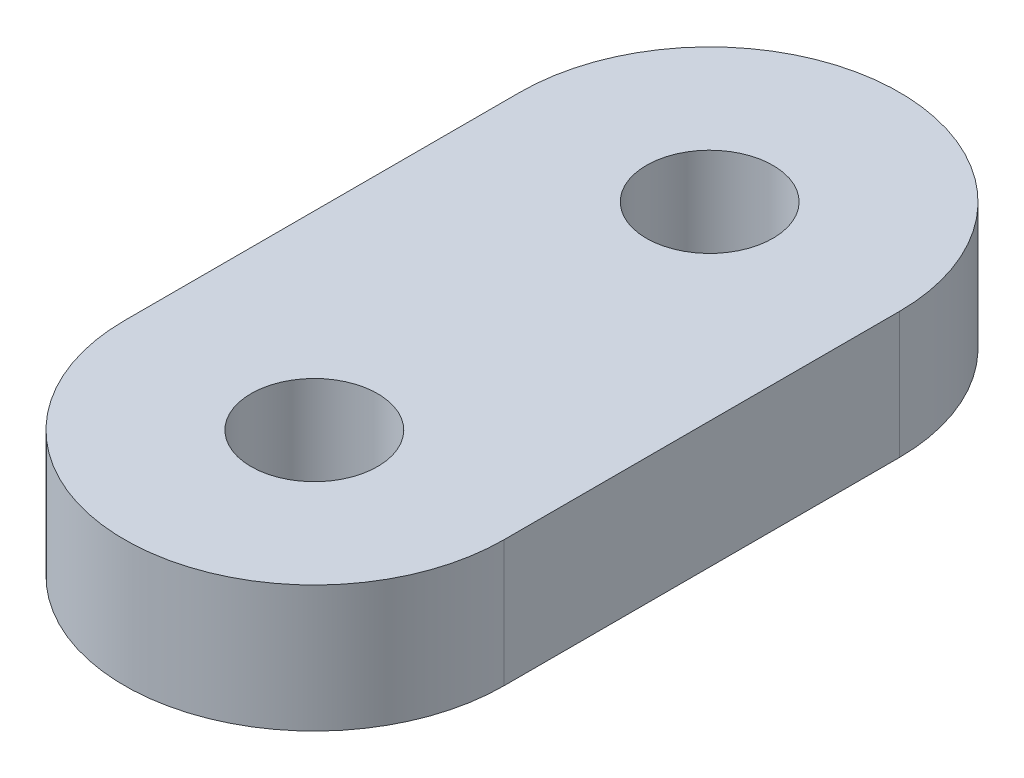
ISO-10303-21;
HEADER;
FILE_DESCRIPTION(('STEP AP214'),'2;1');
FILE_NAME('part.step','',(''),(''),'','','');
FILE_SCHEMA(('AUTOMOTIVE_DESIGN { 1 0 10303 214 1 1 1 1 }'));
ENDSEC;
DATA;
#1=APPLICATION_CONTEXT('core data for automotive mechanical design processes');
#2=APPLICATION_PROTOCOL_DEFINITION('international standard','automotive_design',2000,#1);
#3=PRODUCT_CONTEXT('',#1,'mechanical');
#4=PRODUCT('Part','Part','',(#3));
#5=PRODUCT_RELATED_PRODUCT_CATEGORY('part','',(#4));
#6=PRODUCT_DEFINITION_FORMATION('','',#4);
#7=PRODUCT_DEFINITION_CONTEXT('part definition',#1,'design');
#8=PRODUCT_DEFINITION('design','',#6,#7);
#9=PRODUCT_DEFINITION_SHAPE('','',#8);
#10=(LENGTH_UNIT() NAMED_UNIT(*) SI_UNIT(.MILLI.,.METRE.));
#11=(NAMED_UNIT(*) PLANE_ANGLE_UNIT() SI_UNIT($,.RADIAN.));
#12=(NAMED_UNIT(*) SI_UNIT($,.STERADIAN.) SOLID_ANGLE_UNIT());
#13=UNCERTAINTY_MEASURE_WITH_UNIT(LENGTH_MEASURE(1.E-05),#10,'distance_accuracy_value','');
#14=(GEOMETRIC_REPRESENTATION_CONTEXT(3) GLOBAL_UNCERTAINTY_ASSIGNED_CONTEXT((#13)) GLOBAL_UNIT_ASSIGNED_CONTEXT((#10,
#11,#12)) REPRESENTATION_CONTEXT('',''));
#15=CARTESIAN_POINT('',(0.,0.,0.));
#16=DIRECTION('',(0.,0.,1.));
#17=DIRECTION('',(1.,0.,0.));
#18=AXIS2_PLACEMENT_3D('',#15,#16,#17);
#19=CARTESIAN_POINT('',(0.,4.,-6.25));
#20=DIRECTION('',(0.,-1.,0.));
#21=DIRECTION('',(0.,0.,-1.));
#22=AXIS2_PLACEMENT_3D('',#19,#20,#21);
#23=CYLINDRICAL_SURFACE('',#22,6.);
#24=CARTESIAN_POINT('',(0.,0.,-6.25));
#25=DIRECTION('',(0.,1.,0.));
#26=DIRECTION('',(0.,0.,1.));
#27=AXIS2_PLACEMENT_3D('',#24,#25,#26);
#28=CIRCLE('',#27,6.);
#29=CARTESIAN_POINT('',(6.,0.,-6.25));
#30=VERTEX_POINT('',#29);
#31=CARTESIAN_POINT('',(-6.,0.,-6.25));
#32=VERTEX_POINT('',#31);
#33=EDGE_CURVE('E97',#30,#32,#28,.T.);
#34=ORIENTED_EDGE('',*,*,#33,.T.);
#35=DIRECTION('',(0.,-1.,0.));
#36=VECTOR('',#35,1.);
#37=CARTESIAN_POINT('',(-6.,4.,-6.25));
#38=LINE('',#37,#36);
#39=CARTESIAN_POINT('',(-6.,4.,-6.25));
#40=VERTEX_POINT('',#39);
#41=EDGE_CURVE('E11',#40,#32,#38,.T.);
#42=ORIENTED_EDGE('',*,*,#41,.F.);
#43=CARTESIAN_POINT('',(0.,4.,-6.25));
#44=DIRECTION('',(0.,1.,0.));
#45=DIRECTION('',(0.,0.,1.));
#46=AXIS2_PLACEMENT_3D('',#43,#44,#45);
#47=CIRCLE('',#46,6.);
#48=CARTESIAN_POINT('',(6.,4.,-6.25));
#49=VERTEX_POINT('',#48);
#50=EDGE_CURVE('E85',#49,#40,#47,.T.);
#51=ORIENTED_EDGE('',*,*,#50,.F.);
#52=DIRECTION('',(0.,-1.,0.));
#53=VECTOR('',#52,1.);
#54=CARTESIAN_POINT('',(6.,4.,-6.25));
#55=LINE('',#54,#53);
#56=EDGE_CURVE('E93',#49,#30,#55,.T.);
#57=ORIENTED_EDGE('',*,*,#56,.T.);
#58=EDGE_LOOP('',(#34,#42,#51,#57));
#59=FACE_BOUND('',#58,.T.);
#60=ADVANCED_FACE('F34',(#59),#23,.T.);
#61=CARTESIAN_POINT('',(-6.,4.,-6.25));
#62=DIRECTION('',(1.,0.,0.));
#63=DIRECTION('',(0.,0.,-1.));
#64=AXIS2_PLACEMENT_3D('',#61,#62,#63);
#65=PLANE('',#64);
#66=DIRECTION('',(0.,0.,1.));
#67=VECTOR('',#66,1.);
#68=CARTESIAN_POINT('',(-6.,0.,-6.25));
#69=LINE('',#68,#67);
#70=CARTESIAN_POINT('',(-6.,0.,6.25));
#71=VERTEX_POINT('',#70);
#72=EDGE_CURVE('E89',#32,#71,#69,.T.);
#73=ORIENTED_EDGE('',*,*,#72,.T.);
#74=DIRECTION('',(0.,-1.,0.));
#75=VECTOR('',#74,1.);
#76=CARTESIAN_POINT('',(-6.,4.,6.25));
#77=LINE('',#76,#75);
#78=CARTESIAN_POINT('',(-6.,4.,6.25));
#79=VERTEX_POINT('',#78);
#80=EDGE_CURVE('E42',#79,#71,#77,.T.);
#81=ORIENTED_EDGE('',*,*,#80,.F.);
#82=DIRECTION('',(0.,0.,1.));
#83=VECTOR('',#82,1.);
#84=CARTESIAN_POINT('',(-6.,4.,-6.25));
#85=LINE('',#84,#83);
#86=EDGE_CURVE('E80',#40,#79,#85,.T.);
#87=ORIENTED_EDGE('',*,*,#86,.F.);
#88=ORIENTED_EDGE('',*,*,#41,.T.);
#89=EDGE_LOOP('',(#73,#81,#87,#88));
#90=FACE_BOUND('',#89,.T.);
#91=ADVANCED_FACE('F88',(#90),#65,.F.);
#92=CARTESIAN_POINT('',(0.,4.,6.25));
#93=DIRECTION('',(0.,-1.,0.));
#94=DIRECTION('',(0.,0.,-1.));
#95=AXIS2_PLACEMENT_3D('',#92,#93,#94);
#96=CYLINDRICAL_SURFACE('',#95,6.);
#97=CARTESIAN_POINT('',(0.,0.,6.25));
#98=DIRECTION('',(0.,1.,0.));
#99=DIRECTION('',(0.,0.,1.));
#100=AXIS2_PLACEMENT_3D('',#97,#98,#99);
#101=CIRCLE('',#100,6.);
#102=CARTESIAN_POINT('',(6.,0.,6.25));
#103=VERTEX_POINT('',#102);
#104=EDGE_CURVE('E67',#71,#103,#101,.T.);
#105=ORIENTED_EDGE('',*,*,#104,.T.);
#106=DIRECTION('',(0.,-1.,0.));
#107=VECTOR('',#106,1.);
#108=CARTESIAN_POINT('',(6.,4.,6.25));
#109=LINE('',#108,#107);
#110=CARTESIAN_POINT('',(6.,4.,6.25));
#111=VERTEX_POINT('',#110);
#112=EDGE_CURVE('E90',#111,#103,#109,.T.);
#113=ORIENTED_EDGE('',*,*,#112,.F.);
#114=CARTESIAN_POINT('',(0.,4.,6.25));
#115=DIRECTION('',(0.,1.,0.));
#116=DIRECTION('',(0.,0.,1.));
#117=AXIS2_PLACEMENT_3D('',#114,#115,#116);
#118=CIRCLE('',#117,6.);
#119=EDGE_CURVE('E83',#79,#111,#118,.T.);
#120=ORIENTED_EDGE('',*,*,#119,.F.);
#121=ORIENTED_EDGE('',*,*,#80,.T.);
#122=EDGE_LOOP('',(#105,#113,#120,#121));
#123=FACE_BOUND('',#122,.T.);
#124=ADVANCED_FACE('F91',(#123),#96,.T.);
#125=CARTESIAN_POINT('',(6.,4.,-6.25));
#126=DIRECTION('',(-1.,0.,0.));
#127=DIRECTION('',(0.,0.,1.));
#128=AXIS2_PLACEMENT_3D('',#125,#126,#127);
#129=PLANE('',#128);
#130=DIRECTION('',(0.,0.,-1.));
#131=VECTOR('',#130,1.);
#132=CARTESIAN_POINT('',(6.,0.,-6.25));
#133=LINE('',#132,#131);
#134=EDGE_CURVE('E73',#103,#30,#133,.T.);
#135=ORIENTED_EDGE('',*,*,#134,.T.);
#136=ORIENTED_EDGE('',*,*,#56,.F.);
#137=DIRECTION('',(0.,0.,-1.));
#138=VECTOR('',#137,1.);
#139=CARTESIAN_POINT('',(6.,4.,-6.25));
#140=LINE('',#139,#138);
#141=EDGE_CURVE('E50',#111,#49,#140,.T.);
#142=ORIENTED_EDGE('',*,*,#141,.F.);
#143=ORIENTED_EDGE('',*,*,#112,.T.);
#144=EDGE_LOOP('',(#135,#136,#142,#143));
#145=FACE_BOUND('',#144,.T.);
#146=ADVANCED_FACE('F105',(#145),#129,.F.);
#147=CARTESIAN_POINT('',(0.,4.,-6.25));
#148=DIRECTION('',(0.,1.,0.));
#149=DIRECTION('',(0.,0.,1.));
#150=AXIS2_PLACEMENT_3D('',#147,#148,#149);
#151=PLANE('',#150);
#152=CARTESIAN_POINT('',(0.,4.,6.25));
#153=DIRECTION('',(0.,1.,0.));
#154=DIRECTION('',(0.,0.,1.));
#155=AXIS2_PLACEMENT_3D('',#152,#153,#154);
#156=CIRCLE('',#155,2.);
#157=CARTESIAN_POINT('',(0.,4.,8.25));
#158=VERTEX_POINT('',#157);
#159=EDGE_CURVE('E117',#158,#158,#156,.T.);
#160=ORIENTED_EDGE('',*,*,#159,.F.);
#161=EDGE_LOOP('',(#160));
#162=FACE_BOUND('',#161,.T.);
#163=CARTESIAN_POINT('',(0.,4.,-6.25));
#164=DIRECTION('',(0.,1.,0.));
#165=DIRECTION('',(0.,0.,1.));
#166=AXIS2_PLACEMENT_3D('',#163,#164,#165);
#167=CIRCLE('',#166,2.);
#168=CARTESIAN_POINT('',(0.,4.,-4.25));
#169=VERTEX_POINT('',#168);
#170=EDGE_CURVE('E111',#169,#169,#167,.T.);
#171=ORIENTED_EDGE('',*,*,#170,.F.);
#172=EDGE_LOOP('',(#171));
#173=FACE_BOUND('',#172,.T.);
#174=ORIENTED_EDGE('',*,*,#50,.T.);
#175=ORIENTED_EDGE('',*,*,#86,.T.);
#176=ORIENTED_EDGE('',*,*,#119,.T.);
#177=ORIENTED_EDGE('',*,*,#141,.T.);
#178=EDGE_LOOP('',(#174,#175,#176,#177));
#179=FACE_BOUND('',#178,.T.);
#180=ADVANCED_FACE('F81',(#162,#173,#179),#151,.T.);
#181=CARTESIAN_POINT('',(0.,0.,-6.25));
#182=DIRECTION('',(0.,1.,0.));
#183=DIRECTION('',(0.,0.,1.));
#184=AXIS2_PLACEMENT_3D('',#181,#182,#183);
#185=PLANE('',#184);
#186=CARTESIAN_POINT('',(0.,0.,6.25));
#187=DIRECTION('',(0.,1.,0.));
#188=DIRECTION('',(0.,0.,1.));
#189=AXIS2_PLACEMENT_3D('',#186,#187,#188);
#190=CIRCLE('',#189,2.);
#191=CARTESIAN_POINT('',(0.,0.,8.25));
#192=VERTEX_POINT('',#191);
#193=EDGE_CURVE('E114',#192,#192,#190,.T.);
#194=ORIENTED_EDGE('',*,*,#193,.T.);
#195=EDGE_LOOP('',(#194));
#196=FACE_BOUND('',#195,.T.);
#197=CARTESIAN_POINT('',(0.,0.,-6.25));
#198=DIRECTION('',(0.,1.,0.));
#199=DIRECTION('',(0.,0.,1.));
#200=AXIS2_PLACEMENT_3D('',#197,#198,#199);
#201=CIRCLE('',#200,2.);
#202=CARTESIAN_POINT('',(0.,0.,-4.25));
#203=VERTEX_POINT('',#202);
#204=EDGE_CURVE('E100',#203,#203,#201,.T.);
#205=ORIENTED_EDGE('',*,*,#204,.T.);
#206=EDGE_LOOP('',(#205));
#207=FACE_BOUND('',#206,.T.);
#208=ORIENTED_EDGE('',*,*,#33,.F.);
#209=ORIENTED_EDGE('',*,*,#134,.F.);
#210=ORIENTED_EDGE('',*,*,#104,.F.);
#211=ORIENTED_EDGE('',*,*,#72,.F.);
#212=EDGE_LOOP('',(#208,#209,#210,#211));
#213=FACE_BOUND('',#212,.T.);
#214=ADVANCED_FACE('F108',(#196,#207,#213),#185,.F.);
#215=CARTESIAN_POINT('',(0.,0.,-6.25));
#216=DIRECTION('',(0.,1.,0.));
#217=DIRECTION('',(0.,0.,1.));
#218=AXIS2_PLACEMENT_3D('',#215,#216,#217);
#219=CYLINDRICAL_SURFACE('',#218,2.);
#220=ORIENTED_EDGE('',*,*,#204,.F.);
#221=EDGE_LOOP('',(#220));
#222=FACE_BOUND('',#221,.T.);
#223=ORIENTED_EDGE('',*,*,#170,.T.);
#224=EDGE_LOOP('',(#223));
#225=FACE_BOUND('',#224,.T.);
#226=ADVANCED_FACE('F128',(#222,#225),#219,.F.);
#227=CARTESIAN_POINT('',(0.,0.,6.25));
#228=DIRECTION('',(0.,1.,0.));
#229=DIRECTION('',(0.,0.,1.));
#230=AXIS2_PLACEMENT_3D('',#227,#228,#229);
#231=CYLINDRICAL_SURFACE('',#230,2.);
#232=ORIENTED_EDGE('',*,*,#193,.F.);
#233=EDGE_LOOP('',(#232));
#234=FACE_BOUND('',#233,.T.);
#235=ORIENTED_EDGE('',*,*,#159,.T.);
#236=EDGE_LOOP('',(#235));
#237=FACE_BOUND('',#236,.T.);
#238=ADVANCED_FACE('F125',(#234,#237),#231,.F.);
#239=CLOSED_SHELL('',(#60,#91,#124,#146,#180,#214,#226,#238));
#240=MANIFOLD_SOLID_BREP('B2',#239);
#241=ADVANCED_BREP_SHAPE_REPRESENTATION('',(#18,#240),#14);
#242=SHAPE_DEFINITION_REPRESENTATION(#9,#241);
ENDSEC;
END-ISO-10303-21;
